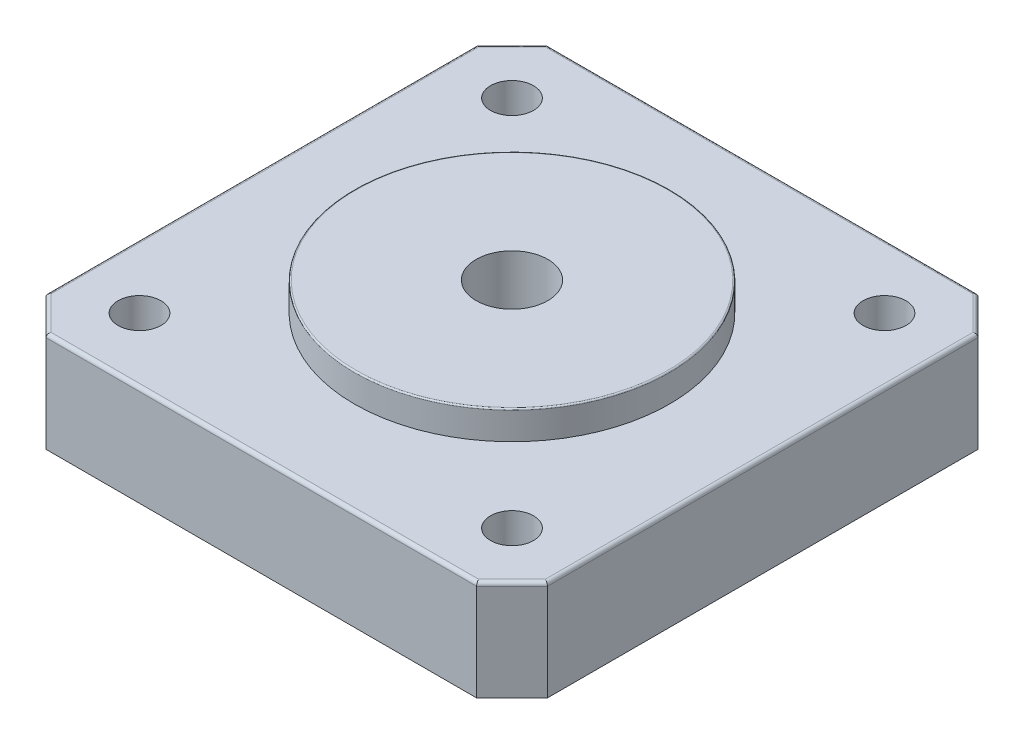
ISO-10303-21;
HEADER;
FILE_DESCRIPTION(('STEP AP214'),'2;1');
FILE_NAME('part.step','',(''),(''),'','','');
FILE_SCHEMA(('AUTOMOTIVE_DESIGN { 1 0 10303 214 1 1 1 1 }'));
ENDSEC;
DATA;
#1=APPLICATION_CONTEXT('core data for automotive mechanical design processes');
#2=APPLICATION_PROTOCOL_DEFINITION('international standard','automotive_design',2000,#1);
#3=PRODUCT_CONTEXT('',#1,'mechanical');
#4=PRODUCT('Part','Part','',(#3));
#5=PRODUCT_RELATED_PRODUCT_CATEGORY('part','',(#4));
#6=PRODUCT_DEFINITION_FORMATION('','',#4);
#7=PRODUCT_DEFINITION_CONTEXT('part definition',#1,'design');
#8=PRODUCT_DEFINITION('design','',#6,#7);
#9=PRODUCT_DEFINITION_SHAPE('','',#8);
#10=(LENGTH_UNIT() NAMED_UNIT(*) SI_UNIT(.MILLI.,.METRE.));
#11=(NAMED_UNIT(*) PLANE_ANGLE_UNIT() SI_UNIT($,.RADIAN.));
#12=(NAMED_UNIT(*) SI_UNIT($,.STERADIAN.) SOLID_ANGLE_UNIT());
#13=UNCERTAINTY_MEASURE_WITH_UNIT(LENGTH_MEASURE(1.E-05),#10,'distance_accuracy_value','');
#14=(GEOMETRIC_REPRESENTATION_CONTEXT(3) GLOBAL_UNCERTAINTY_ASSIGNED_CONTEXT((#13)) GLOBAL_UNIT_ASSIGNED_CONTEXT((#10,
#11,#12)) REPRESENTATION_CONTEXT('',''));
#15=CARTESIAN_POINT('',(0.,0.,0.));
#16=DIRECTION('',(0.,0.,1.));
#17=DIRECTION('',(1.,0.,0.));
#18=AXIS2_PLACEMENT_3D('',#15,#16,#17);
#19=CARTESIAN_POINT('',(0.,7.,0.));
#20=DIRECTION('',(0.,-1.,0.));
#21=DIRECTION('',(0.,0.,-1.));
#22=AXIS2_PLACEMENT_3D('',#19,#20,#21);
#23=PLANE('',#22);
#24=DIRECTION('',(-1.,0.,0.));
#25=VECTOR('',#24,1.);
#26=CARTESIAN_POINT('',(0.,7.,-34.75));
#27=LINE('',#26,#25);
#28=CARTESIAN_POINT('',(32.4233585439879,7.,-34.75));
#29=VERTEX_POINT('',#28);
#30=CARTESIAN_POINT('',(2.5766414560121,7.,-34.75));
#31=VERTEX_POINT('',#30);
#32=EDGE_CURVE('E198',#29,#31,#27,.T.);
#33=ORIENTED_EDGE('',*,*,#32,.T.);
#34=DIRECTION('',(-0.707106781186548,0.,0.707106781186548));
#35=VECTOR('',#34,1.);
#36=CARTESIAN_POINT('',(-16.0866792719939,7.,-16.0866792719939));
#37=LINE('',#36,#35);
#38=CARTESIAN_POINT('',(0.25,7.,-32.4233585439879));
#39=VERTEX_POINT('',#38);
#40=EDGE_CURVE('E200',#31,#39,#37,.T.);
#41=ORIENTED_EDGE('',*,*,#40,.T.);
#42=DIRECTION('',(0.,0.,1.));
#43=VECTOR('',#42,1.);
#44=CARTESIAN_POINT('',(0.250000000000008,7.,0.));
#45=LINE('',#44,#43);
#46=CARTESIAN_POINT('',(0.250000000000007,7.,-2.57664145601209));
#47=VERTEX_POINT('',#46);
#48=EDGE_CURVE('E186',#39,#47,#45,.T.);
#49=ORIENTED_EDGE('',*,*,#48,.T.);
#50=DIRECTION('',(0.707106781186618,0.,0.707106781186477));
#51=VECTOR('',#50,1.);
#52=CARTESIAN_POINT('',(1.41332072800602,7.,-1.41332072800631));
#53=LINE('',#52,#51);
#54=CARTESIAN_POINT('',(2.57664145601238,7.,-0.250000000000184));
#55=VERTEX_POINT('',#54);
#56=EDGE_CURVE('E188',#47,#55,#53,.T.);
#57=ORIENTED_EDGE('',*,*,#56,.T.);
#58=DIRECTION('',(1.,0.,0.));
#59=VECTOR('',#58,1.);
#60=CARTESIAN_POINT('',(0.,7.,-0.250000000000201));
#61=LINE('',#60,#59);
#62=CARTESIAN_POINT('',(32.4233585439879,7.,-0.249999999999987));
#63=VERTEX_POINT('',#62);
#64=EDGE_CURVE('E190',#55,#63,#61,.T.);
#65=ORIENTED_EDGE('',*,*,#64,.T.);
#66=DIRECTION('',(0.707106781186548,0.,-0.707106781186548));
#67=VECTOR('',#66,1.);
#68=CARTESIAN_POINT('',(16.086679271994,7.,16.086679271994));
#69=LINE('',#68,#67);
#70=CARTESIAN_POINT('',(34.75,7.,-2.57664145601208));
#71=VERTEX_POINT('',#70);
#72=EDGE_CURVE('E192',#63,#71,#69,.T.);
#73=ORIENTED_EDGE('',*,*,#72,.T.);
#74=DIRECTION('',(0.,0.,-1.));
#75=VECTOR('',#74,1.);
#76=CARTESIAN_POINT('',(34.75,7.,0.));
#77=LINE('',#76,#75);
#78=CARTESIAN_POINT('',(34.75,7.,-32.4233585439879));
#79=VERTEX_POINT('',#78);
#80=EDGE_CURVE('E194',#71,#79,#77,.T.);
#81=ORIENTED_EDGE('',*,*,#80,.T.);
#82=DIRECTION('',(-0.707106781186547,0.,-0.707106781186548));
#83=VECTOR('',#82,1.);
#84=CARTESIAN_POINT('',(33.586679271994,7.,-33.5866792719939));
#85=LINE('',#84,#83);
#86=EDGE_CURVE('E196',#79,#29,#85,.T.);
#87=ORIENTED_EDGE('',*,*,#86,.T.);
#88=EDGE_LOOP('',(#33,#41,#49,#57,#65,#73,#81,#87));
#89=FACE_BOUND('',#88,.T.);
#90=CARTESIAN_POINT('',(4.50000000000001,7.,-30.5));
#91=DIRECTION('',(0.,1.,0.));
#92=DIRECTION('',(0.,0.,1.));
#93=AXIS2_PLACEMENT_3D('',#90,#91,#92);
#94=CIRCLE('',#93,1.5);
#95=CARTESIAN_POINT('',(4.50000000000001,7.,-29.));
#96=VERTEX_POINT('',#95);
#97=EDGE_CURVE('E263',#96,#96,#94,.T.);
#98=ORIENTED_EDGE('',*,*,#97,.F.);
#99=EDGE_LOOP('',(#98));
#100=FACE_BOUND('',#99,.T.);
#101=CARTESIAN_POINT('',(30.5000000000001,7.,-30.5000000000003));
#102=DIRECTION('',(0.,1.,0.));
#103=DIRECTION('',(0.,0.,1.));
#104=AXIS2_PLACEMENT_3D('',#101,#102,#103);
#105=CIRCLE('',#104,1.5);
#106=CARTESIAN_POINT('',(30.5000000000001,7.,-29.0000000000003));
#107=VERTEX_POINT('',#106);
#108=EDGE_CURVE('E257',#107,#107,#105,.T.);
#109=ORIENTED_EDGE('',*,*,#108,.F.);
#110=EDGE_LOOP('',(#109));
#111=FACE_BOUND('',#110,.T.);
#112=CARTESIAN_POINT('',(30.5000000000003,7.,-4.50000000000026));
#113=DIRECTION('',(0.,1.,0.));
#114=DIRECTION('',(0.,0.,1.));
#115=AXIS2_PLACEMENT_3D('',#112,#113,#114);
#116=CIRCLE('',#115,1.5);
#117=CARTESIAN_POINT('',(30.5000000000003,7.,-3.00000000000026));
#118=VERTEX_POINT('',#117);
#119=EDGE_CURVE('E252',#118,#118,#116,.T.);
#120=ORIENTED_EDGE('',*,*,#119,.F.);
#121=EDGE_LOOP('',(#120));
#122=FACE_BOUND('',#121,.T.);
#123=CARTESIAN_POINT('',(4.50000000000024,7.,-4.50000000000012));
#124=DIRECTION('',(0.,1.,0.));
#125=DIRECTION('',(0.,0.,1.));
#126=AXIS2_PLACEMENT_3D('',#123,#124,#125);
#127=CIRCLE('',#126,1.5);
#128=CARTESIAN_POINT('',(4.50000000000024,7.,-3.00000000000012));
#129=VERTEX_POINT('',#128);
#130=EDGE_CURVE('E243',#129,#129,#127,.T.);
#131=ORIENTED_EDGE('',*,*,#130,.F.);
#132=EDGE_LOOP('',(#131));
#133=FACE_BOUND('',#132,.T.);
#134=CARTESIAN_POINT('',(17.5,7.,-17.5));
#135=DIRECTION('',(0.,-1.,0.));
#136=DIRECTION('',(0.,0.,-1.));
#137=AXIS2_PLACEMENT_3D('',#134,#135,#136);
#138=CIRCLE('',#137,11.);
#139=CARTESIAN_POINT('',(17.5,7.,-28.5));
#140=VERTEX_POINT('',#139);
#141=EDGE_CURVE('E128',#140,#140,#138,.F.);
#142=ORIENTED_EDGE('',*,*,#141,.F.);
#143=EDGE_LOOP('',(#142));
#144=FACE_BOUND('',#143,.T.);
#145=ADVANCED_FACE('F32',(#89,#100,#111,#122,#133,#144),#23,.F.);
#146=CARTESIAN_POINT('',(0.,7.,-2.4730880654188));
#147=DIRECTION('',(1.,0.,0.));
#148=DIRECTION('',(0.,0.,-1.));
#149=AXIS2_PLACEMENT_3D('',#146,#147,#148);
#150=PLANE('',#149);
#151=DIRECTION('',(0.,-1.,0.));
#152=VECTOR('',#151,1.);
#153=CARTESIAN_POINT('',(0.,7.,-2.4730880654188));
#154=LINE('',#153,#152);
#155=CARTESIAN_POINT('',(0.,6.75,-2.4730880654188));
#156=VERTEX_POINT('',#155);
#157=CARTESIAN_POINT('',(0.,0.,-2.4730880654188));
#158=VERTEX_POINT('',#157);
#159=EDGE_CURVE('E120',#156,#158,#154,.T.);
#160=ORIENTED_EDGE('',*,*,#159,.F.);
#161=DIRECTION('',(0.,0.,1.));
#162=VECTOR('',#161,1.);
#163=CARTESIAN_POINT('',(0.,6.75,-2.4730880654188));
#164=LINE('',#163,#162);
#165=CARTESIAN_POINT('',(0.,6.75,-32.5269119345812));
#166=VERTEX_POINT('',#165);
#167=EDGE_CURVE('E11',#156,#166,#164,.F.);
#168=ORIENTED_EDGE('',*,*,#167,.T.);
#169=DIRECTION('',(0.,-1.,0.));
#170=VECTOR('',#169,1.);
#171=CARTESIAN_POINT('',(0.,7.,-32.5269119345812));
#172=LINE('',#171,#170);
#173=CARTESIAN_POINT('',(0.,0.,-32.5269119345812));
#174=VERTEX_POINT('',#173);
#175=EDGE_CURVE('E142',#166,#174,#172,.T.);
#176=ORIENTED_EDGE('',*,*,#175,.T.);
#177=DIRECTION('',(0.,0.,1.));
#178=VECTOR('',#177,1.);
#179=CARTESIAN_POINT('',(0.,0.,-2.4730880654188));
#180=LINE('',#179,#178);
#181=EDGE_CURVE('E135',#174,#158,#180,.T.);
#182=ORIENTED_EDGE('',*,*,#181,.T.);
#183=EDGE_LOOP('',(#160,#168,#176,#182));
#184=FACE_BOUND('',#183,.T.);
#185=ADVANCED_FACE('F140',(#184),#150,.F.);
#186=CARTESIAN_POINT('',(2.47308806541912,7.,-1.8457620525144E-13));
#187=DIRECTION('',(0.707106781186477,0.,-0.707106781186618));
#188=DIRECTION('',(-0.707106781186618,0.,-0.707106781186477));
#189=AXIS2_PLACEMENT_3D('',#186,#187,#188);
#190=PLANE('',#189);
#191=DIRECTION('',(0.,-1.,0.));
#192=VECTOR('',#191,1.);
#193=CARTESIAN_POINT('',(2.47308806541912,7.,-1.8457620525144E-13));
#194=LINE('',#193,#192);
#195=CARTESIAN_POINT('',(2.47308806541912,6.75,-1.8457620525144E-13));
#196=VERTEX_POINT('',#195);
#197=CARTESIAN_POINT('',(2.47308806541912,0.,-1.8457620525144E-13));
#198=VERTEX_POINT('',#197);
#199=EDGE_CURVE('E129',#196,#198,#194,.T.);
#200=ORIENTED_EDGE('',*,*,#199,.F.);
#201=DIRECTION('',(0.707106781186618,0.,0.707106781186477));
#202=VECTOR('',#201,1.);
#203=CARTESIAN_POINT('',(2.47308806541912,6.75,-1.8457620525144E-13));
#204=LINE('',#203,#202);
#205=EDGE_CURVE('E41',#196,#156,#204,.F.);
#206=ORIENTED_EDGE('',*,*,#205,.T.);
#207=ORIENTED_EDGE('',*,*,#159,.T.);
#208=DIRECTION('',(0.707106781186618,0.,0.707106781186477));
#209=VECTOR('',#208,1.);
#210=CARTESIAN_POINT('',(2.47308806541912,0.,-1.8457620525144E-13));
#211=LINE('',#210,#209);
#212=EDGE_CURVE('E123',#158,#198,#211,.T.);
#213=ORIENTED_EDGE('',*,*,#212,.T.);
#214=EDGE_LOOP('',(#200,#206,#207,#213));
#215=FACE_BOUND('',#214,.T.);
#216=ADVANCED_FACE('F122',(#215),#190,.F.);
#217=CARTESIAN_POINT('',(2.47308806541912,7.,-1.8457620525144E-13));
#218=DIRECTION('',(0.,0.,-1.));
#219=DIRECTION('',(-1.,0.,0.));
#220=AXIS2_PLACEMENT_3D('',#217,#218,#219);
#221=PLANE('',#220);
#222=DIRECTION('',(0.,-1.,0.));
#223=VECTOR('',#222,1.);
#224=CARTESIAN_POINT('',(32.5269119345812,7.,0.));
#225=LINE('',#224,#223);
#226=CARTESIAN_POINT('',(32.5269119345812,6.75,0.));
#227=VERTEX_POINT('',#226);
#228=CARTESIAN_POINT('',(32.5269119345812,0.,0.));
#229=VERTEX_POINT('',#228);
#230=EDGE_CURVE('E175',#227,#229,#225,.T.);
#231=ORIENTED_EDGE('',*,*,#230,.F.);
#232=DIRECTION('',(1.,0.,0.));
#233=VECTOR('',#232,1.);
#234=CARTESIAN_POINT('',(2.47308806541912,6.75,-1.8457620525144E-13));
#235=LINE('',#234,#233);
#236=EDGE_CURVE('E56',#227,#196,#235,.F.);
#237=ORIENTED_EDGE('',*,*,#236,.T.);
#238=ORIENTED_EDGE('',*,*,#199,.T.);
#239=DIRECTION('',(1.,0.,0.));
#240=VECTOR('',#239,1.);
#241=CARTESIAN_POINT('',(2.47308806541912,0.,-1.8457620525144E-13));
#242=LINE('',#241,#240);
#243=EDGE_CURVE('E138',#198,#229,#242,.T.);
#244=ORIENTED_EDGE('',*,*,#243,.T.);
#245=EDGE_LOOP('',(#231,#237,#238,#244));
#246=FACE_BOUND('',#245,.T.);
#247=ADVANCED_FACE('F340',(#246),#221,.F.);
#248=CARTESIAN_POINT('',(35.,7.,-2.47308806541881));
#249=DIRECTION('',(-0.707106781186547,0.,-0.707106781186547));
#250=DIRECTION('',(-0.707106781186548,0.,0.707106781186548));
#251=AXIS2_PLACEMENT_3D('',#248,#249,#250);
#252=PLANE('',#251);
#253=DIRECTION('',(0.,-1.,0.));
#254=VECTOR('',#253,1.);
#255=CARTESIAN_POINT('',(35.,7.,-2.47308806541881));
#256=LINE('',#255,#254);
#257=CARTESIAN_POINT('',(35.,6.75,-2.47308806541881));
#258=VERTEX_POINT('',#257);
#259=CARTESIAN_POINT('',(35.,0.,-2.47308806541881));
#260=VERTEX_POINT('',#259);
#261=EDGE_CURVE('E173',#258,#260,#256,.T.);
#262=ORIENTED_EDGE('',*,*,#261,.F.);
#263=DIRECTION('',(0.707106781186548,0.,-0.707106781186548));
#264=VECTOR('',#263,1.);
#265=CARTESIAN_POINT('',(35.,6.75,-2.47308806541881));
#266=LINE('',#265,#264);
#267=EDGE_CURVE('E212',#258,#227,#266,.F.);
#268=ORIENTED_EDGE('',*,*,#267,.T.);
#269=ORIENTED_EDGE('',*,*,#230,.T.);
#270=DIRECTION('',(0.707106781186548,0.,-0.707106781186548));
#271=VECTOR('',#270,1.);
#272=CARTESIAN_POINT('',(35.,0.,-2.47308806541881));
#273=LINE('',#272,#271);
#274=EDGE_CURVE('E152',#229,#260,#273,.T.);
#275=ORIENTED_EDGE('',*,*,#274,.T.);
#276=EDGE_LOOP('',(#262,#268,#269,#275));
#277=FACE_BOUND('',#276,.T.);
#278=ADVANCED_FACE('F336',(#277),#252,.F.);
#279=CARTESIAN_POINT('',(35.,7.,-2.47308806541881));
#280=DIRECTION('',(-1.,0.,0.));
#281=DIRECTION('',(0.,0.,1.));
#282=AXIS2_PLACEMENT_3D('',#279,#280,#281);
#283=PLANE('',#282);
#284=DIRECTION('',(0.,-1.,0.));
#285=VECTOR('',#284,1.);
#286=CARTESIAN_POINT('',(35.,7.,-32.5269119345812));
#287=LINE('',#286,#285);
#288=CARTESIAN_POINT('',(35.,6.75,-32.5269119345812));
#289=VERTEX_POINT('',#288);
#290=CARTESIAN_POINT('',(35.,0.,-32.5269119345812));
#291=VERTEX_POINT('',#290);
#292=EDGE_CURVE('E171',#289,#291,#287,.T.);
#293=ORIENTED_EDGE('',*,*,#292,.F.);
#294=DIRECTION('',(0.,0.,-1.));
#295=VECTOR('',#294,1.);
#296=CARTESIAN_POINT('',(35.,6.75,-2.47308806541881));
#297=LINE('',#296,#295);
#298=EDGE_CURVE('E210',#289,#258,#297,.F.);
#299=ORIENTED_EDGE('',*,*,#298,.T.);
#300=ORIENTED_EDGE('',*,*,#261,.T.);
#301=DIRECTION('',(0.,0.,-1.));
#302=VECTOR('',#301,1.);
#303=CARTESIAN_POINT('',(35.,0.,-2.47308806541881));
#304=LINE('',#303,#302);
#305=EDGE_CURVE('E155',#260,#291,#304,.T.);
#306=ORIENTED_EDGE('',*,*,#305,.T.);
#307=EDGE_LOOP('',(#293,#299,#300,#306));
#308=FACE_BOUND('',#307,.T.);
#309=ADVANCED_FACE('F332',(#308),#283,.F.);
#310=CARTESIAN_POINT('',(32.5269119345812,7.,-35.));
#311=DIRECTION('',(-0.707106781186548,0.,0.707106781186547));
#312=DIRECTION('',(0.707106781186547,0.,0.707106781186548));
#313=AXIS2_PLACEMENT_3D('',#310,#311,#312);
#314=PLANE('',#313);
#315=DIRECTION('',(0.,-1.,0.));
#316=VECTOR('',#315,1.);
#317=CARTESIAN_POINT('',(32.5269119345812,7.,-35.));
#318=LINE('',#317,#316);
#319=CARTESIAN_POINT('',(32.5269119345812,6.75,-35.));
#320=VERTEX_POINT('',#319);
#321=CARTESIAN_POINT('',(32.5269119345812,0.,-35.));
#322=VERTEX_POINT('',#321);
#323=EDGE_CURVE('E169',#320,#322,#318,.T.);
#324=ORIENTED_EDGE('',*,*,#323,.F.);
#325=DIRECTION('',(-0.707106781186547,0.,-0.707106781186548));
#326=VECTOR('',#325,1.);
#327=CARTESIAN_POINT('',(32.5269119345812,6.75,-35.));
#328=LINE('',#327,#326);
#329=EDGE_CURVE('E208',#320,#289,#328,.F.);
#330=ORIENTED_EDGE('',*,*,#329,.T.);
#331=ORIENTED_EDGE('',*,*,#292,.T.);
#332=DIRECTION('',(-0.707106781186547,0.,-0.707106781186548));
#333=VECTOR('',#332,1.);
#334=CARTESIAN_POINT('',(32.5269119345812,0.,-35.));
#335=LINE('',#334,#333);
#336=EDGE_CURVE('E158',#291,#322,#335,.T.);
#337=ORIENTED_EDGE('',*,*,#336,.T.);
#338=EDGE_LOOP('',(#324,#330,#331,#337));
#339=FACE_BOUND('',#338,.T.);
#340=ADVANCED_FACE('F328',(#339),#314,.F.);
#341=CARTESIAN_POINT('',(2.47308806541883,7.,-35.));
#342=DIRECTION('',(0.,0.,1.));
#343=DIRECTION('',(1.,0.,0.));
#344=AXIS2_PLACEMENT_3D('',#341,#342,#343);
#345=PLANE('',#344);
#346=DIRECTION('',(0.,-1.,0.));
#347=VECTOR('',#346,1.);
#348=CARTESIAN_POINT('',(2.47308806541883,7.,-35.));
#349=LINE('',#348,#347);
#350=CARTESIAN_POINT('',(2.47308806541883,6.75,-35.));
#351=VERTEX_POINT('',#350);
#352=CARTESIAN_POINT('',(2.47308806541883,0.,-35.));
#353=VERTEX_POINT('',#352);
#354=EDGE_CURVE('E167',#351,#353,#349,.T.);
#355=ORIENTED_EDGE('',*,*,#354,.F.);
#356=DIRECTION('',(-1.,0.,0.));
#357=VECTOR('',#356,1.);
#358=CARTESIAN_POINT('',(2.47308806541883,6.75,-35.));
#359=LINE('',#358,#357);
#360=EDGE_CURVE('E206',#351,#320,#359,.F.);
#361=ORIENTED_EDGE('',*,*,#360,.T.);
#362=ORIENTED_EDGE('',*,*,#323,.T.);
#363=DIRECTION('',(-1.,0.,0.));
#364=VECTOR('',#363,1.);
#365=CARTESIAN_POINT('',(2.47308806541883,0.,-35.));
#366=LINE('',#365,#364);
#367=EDGE_CURVE('E161',#322,#353,#366,.T.);
#368=ORIENTED_EDGE('',*,*,#367,.T.);
#369=EDGE_LOOP('',(#355,#361,#362,#368));
#370=FACE_BOUND('',#369,.T.);
#371=ADVANCED_FACE('F324',(#370),#345,.F.);
#372=CARTESIAN_POINT('',(0.,7.,-32.5269119345812));
#373=DIRECTION('',(0.707106781186547,0.,0.707106781186547));
#374=DIRECTION('',(0.707106781186548,0.,-0.707106781186548));
#375=AXIS2_PLACEMENT_3D('',#372,#373,#374);
#376=PLANE('',#375);
#377=ORIENTED_EDGE('',*,*,#175,.F.);
#378=DIRECTION('',(-0.707106781186548,0.,0.707106781186548));
#379=VECTOR('',#378,1.);
#380=CARTESIAN_POINT('',(0.,6.75,-32.5269119345812));
#381=LINE('',#380,#379);
#382=EDGE_CURVE('E203',#166,#351,#381,.F.);
#383=ORIENTED_EDGE('',*,*,#382,.T.);
#384=ORIENTED_EDGE('',*,*,#354,.T.);
#385=DIRECTION('',(-0.707106781186548,0.,0.707106781186548));
#386=VECTOR('',#385,1.);
#387=CARTESIAN_POINT('',(0.,0.,-32.5269119345812));
#388=LINE('',#387,#386);
#389=EDGE_CURVE('E164',#353,#174,#388,.T.);
#390=ORIENTED_EDGE('',*,*,#389,.T.);
#391=EDGE_LOOP('',(#377,#383,#384,#390));
#392=FACE_BOUND('',#391,.T.);
#393=ADVANCED_FACE('F320',(#392),#376,.F.);
#394=CARTESIAN_POINT('',(0.,0.,0.));
#395=DIRECTION('',(0.,-1.,0.));
#396=DIRECTION('',(0.,0.,-1.));
#397=AXIS2_PLACEMENT_3D('',#394,#395,#396);
#398=PLANE('',#397);
#399=CARTESIAN_POINT('',(4.50000000000024,0.,-4.50000000000012));
#400=DIRECTION('',(0.,1.,0.));
#401=DIRECTION('',(0.,0.,1.));
#402=AXIS2_PLACEMENT_3D('',#399,#400,#401);
#403=CIRCLE('',#402,1.5);
#404=CARTESIAN_POINT('',(4.50000000000024,0.,-3.00000000000012));
#405=VERTEX_POINT('',#404);
#406=EDGE_CURVE('E248',#405,#405,#403,.T.);
#407=ORIENTED_EDGE('',*,*,#406,.T.);
#408=EDGE_LOOP('',(#407));
#409=FACE_BOUND('',#408,.T.);
#410=CARTESIAN_POINT('',(30.5000000000003,0.,-4.50000000000026));
#411=DIRECTION('',(0.,1.,0.));
#412=DIRECTION('',(0.,0.,1.));
#413=AXIS2_PLACEMENT_3D('',#410,#411,#412);
#414=CIRCLE('',#413,1.5);
#415=CARTESIAN_POINT('',(30.5000000000003,0.,-3.00000000000026));
#416=VERTEX_POINT('',#415);
#417=EDGE_CURVE('E254',#416,#416,#414,.T.);
#418=ORIENTED_EDGE('',*,*,#417,.T.);
#419=EDGE_LOOP('',(#418));
#420=FACE_BOUND('',#419,.T.);
#421=CARTESIAN_POINT('',(30.5000000000001,0.,-30.5000000000003));
#422=DIRECTION('',(0.,1.,0.));
#423=DIRECTION('',(0.,0.,1.));
#424=AXIS2_PLACEMENT_3D('',#421,#422,#423);
#425=CIRCLE('',#424,1.5);
#426=CARTESIAN_POINT('',(30.5000000000001,0.,-29.0000000000003));
#427=VERTEX_POINT('',#426);
#428=EDGE_CURVE('E260',#427,#427,#425,.T.);
#429=ORIENTED_EDGE('',*,*,#428,.T.);
#430=EDGE_LOOP('',(#429));
#431=FACE_BOUND('',#430,.T.);
#432=CARTESIAN_POINT('',(4.50000000000001,0.,-30.5));
#433=DIRECTION('',(0.,1.,0.));
#434=DIRECTION('',(0.,0.,1.));
#435=AXIS2_PLACEMENT_3D('',#432,#433,#434);
#436=CIRCLE('',#435,1.5);
#437=CARTESIAN_POINT('',(4.50000000000001,0.,-29.));
#438=VERTEX_POINT('',#437);
#439=EDGE_CURVE('E147',#438,#438,#436,.T.);
#440=ORIENTED_EDGE('',*,*,#439,.T.);
#441=EDGE_LOOP('',(#440));
#442=FACE_BOUND('',#441,.T.);
#443=CARTESIAN_POINT('',(17.5,0.,-17.5));
#444=DIRECTION('',(0.,1.,0.));
#445=DIRECTION('',(0.,0.,1.));
#446=AXIS2_PLACEMENT_3D('',#443,#444,#445);
#447=CIRCLE('',#446,2.5);
#448=CARTESIAN_POINT('',(17.5,0.,-15.));
#449=VERTEX_POINT('',#448);
#450=EDGE_CURVE('E144',#449,#449,#447,.T.);
#451=ORIENTED_EDGE('',*,*,#450,.T.);
#452=EDGE_LOOP('',(#451));
#453=FACE_BOUND('',#452,.T.);
#454=ORIENTED_EDGE('',*,*,#181,.F.);
#455=ORIENTED_EDGE('',*,*,#389,.F.);
#456=ORIENTED_EDGE('',*,*,#367,.F.);
#457=ORIENTED_EDGE('',*,*,#336,.F.);
#458=ORIENTED_EDGE('',*,*,#305,.F.);
#459=ORIENTED_EDGE('',*,*,#274,.F.);
#460=ORIENTED_EDGE('',*,*,#243,.F.);
#461=ORIENTED_EDGE('',*,*,#212,.F.);
#462=EDGE_LOOP('',(#454,#455,#456,#457,#458,#459,#460,#461));
#463=FACE_BOUND('',#462,.T.);
#464=ADVANCED_FACE('F133',(#409,#420,#431,#442,#453,#463),#398,.T.);
#465=CARTESIAN_POINT('',(17.5,0.,-17.5));
#466=DIRECTION('',(0.,1.,0.));
#467=DIRECTION('',(0.,0.,1.));
#468=AXIS2_PLACEMENT_3D('',#465,#466,#467);
#469=CYLINDRICAL_SURFACE('',#468,2.5);
#470=ORIENTED_EDGE('',*,*,#450,.F.);
#471=EDGE_LOOP('',(#470));
#472=FACE_BOUND('',#471,.T.);
#473=CARTESIAN_POINT('',(17.5,9.,-17.5));
#474=DIRECTION('',(0.,1.,0.));
#475=DIRECTION('',(0.,0.,1.));
#476=AXIS2_PLACEMENT_3D('',#473,#474,#475);
#477=CIRCLE('',#476,2.5);
#478=CARTESIAN_POINT('',(17.5,9.,-15.));
#479=VERTEX_POINT('',#478);
#480=EDGE_CURVE('E237',#479,#479,#477,.T.);
#481=ORIENTED_EDGE('',*,*,#480,.T.);
#482=EDGE_LOOP('',(#481));
#483=FACE_BOUND('',#482,.T.);
#484=ADVANCED_FACE('F313',(#472,#483),#469,.F.);
#485=CARTESIAN_POINT('',(4.50000000000001,0.,-30.5));
#486=DIRECTION('',(0.,1.,0.));
#487=DIRECTION('',(0.,0.,1.));
#488=AXIS2_PLACEMENT_3D('',#485,#486,#487);
#489=CYLINDRICAL_SURFACE('',#488,1.5);
#490=ORIENTED_EDGE('',*,*,#439,.F.);
#491=EDGE_LOOP('',(#490));
#492=FACE_BOUND('',#491,.T.);
#493=ORIENTED_EDGE('',*,*,#97,.T.);
#494=EDGE_LOOP('',(#493));
#495=FACE_BOUND('',#494,.T.);
#496=ADVANCED_FACE('F270',(#492,#495),#489,.F.);
#497=CARTESIAN_POINT('',(30.5000000000001,0.,-30.5000000000003));
#498=DIRECTION('',(0.,1.,0.));
#499=DIRECTION('',(0.,0.,1.));
#500=AXIS2_PLACEMENT_3D('',#497,#498,#499);
#501=CYLINDRICAL_SURFACE('',#500,1.5);
#502=ORIENTED_EDGE('',*,*,#428,.F.);
#503=EDGE_LOOP('',(#502));
#504=FACE_BOUND('',#503,.T.);
#505=ORIENTED_EDGE('',*,*,#108,.T.);
#506=EDGE_LOOP('',(#505));
#507=FACE_BOUND('',#506,.T.);
#508=ADVANCED_FACE('F306',(#504,#507),#501,.F.);
#509=CARTESIAN_POINT('',(30.5000000000003,0.,-4.50000000000026));
#510=DIRECTION('',(0.,1.,0.));
#511=DIRECTION('',(0.,0.,1.));
#512=AXIS2_PLACEMENT_3D('',#509,#510,#511);
#513=CYLINDRICAL_SURFACE('',#512,1.5);
#514=ORIENTED_EDGE('',*,*,#417,.F.);
#515=EDGE_LOOP('',(#514));
#516=FACE_BOUND('',#515,.T.);
#517=ORIENTED_EDGE('',*,*,#119,.T.);
#518=EDGE_LOOP('',(#517));
#519=FACE_BOUND('',#518,.T.);
#520=ADVANCED_FACE('F302',(#516,#519),#513,.F.);
#521=CARTESIAN_POINT('',(4.50000000000024,0.,-4.50000000000012));
#522=DIRECTION('',(0.,1.,0.));
#523=DIRECTION('',(0.,0.,1.));
#524=AXIS2_PLACEMENT_3D('',#521,#522,#523);
#525=CYLINDRICAL_SURFACE('',#524,1.5);
#526=ORIENTED_EDGE('',*,*,#406,.F.);
#527=EDGE_LOOP('',(#526));
#528=FACE_BOUND('',#527,.T.);
#529=ORIENTED_EDGE('',*,*,#130,.T.);
#530=EDGE_LOOP('',(#529));
#531=FACE_BOUND('',#530,.T.);
#532=ADVANCED_FACE('F296',(#528,#531),#525,.F.);
#533=CARTESIAN_POINT('',(17.5,9.,-17.5));
#534=DIRECTION('',(0.,1.,0.));
#535=DIRECTION('',(0.,0.,1.));
#536=AXIS2_PLACEMENT_3D('',#533,#534,#535);
#537=PLANE('',#536);
#538=CARTESIAN_POINT('',(17.5,9.,-17.5));
#539=DIRECTION('',(0.,1.,0.));
#540=DIRECTION('',(0.,0.,1.));
#541=AXIS2_PLACEMENT_3D('',#538,#539,#540);
#542=CIRCLE('',#541,10.9);
#543=CARTESIAN_POINT('',(17.5,9.,-6.59999999999999));
#544=VERTEX_POINT('',#543);
#545=EDGE_CURVE('E180',#544,#544,#542,.T.);
#546=ORIENTED_EDGE('',*,*,#545,.T.);
#547=EDGE_LOOP('',(#546));
#548=FACE_BOUND('',#547,.T.);
#549=ORIENTED_EDGE('',*,*,#480,.F.);
#550=EDGE_LOOP('',(#549));
#551=FACE_BOUND('',#550,.T.);
#552=ADVANCED_FACE('F287',(#548,#551),#537,.T.);
#553=CARTESIAN_POINT('',(17.5,9.,-17.5));
#554=DIRECTION('',(0.,-1.,0.));
#555=DIRECTION('',(0.,0.,-1.));
#556=AXIS2_PLACEMENT_3D('',#553,#554,#555);
#557=CYLINDRICAL_SURFACE('',#556,11.);
#558=CARTESIAN_POINT('',(17.5,8.9,-17.5));
#559=DIRECTION('',(0.,1.,0.));
#560=DIRECTION('',(0.,0.,1.));
#561=AXIS2_PLACEMENT_3D('',#558,#559,#560);
#562=CIRCLE('',#561,11.);
#563=CARTESIAN_POINT('',(17.5,8.9,-6.5));
#564=VERTEX_POINT('',#563);
#565=EDGE_CURVE('E183',#564,#564,#562,.F.);
#566=ORIENTED_EDGE('',*,*,#565,.T.);
#567=EDGE_LOOP('',(#566));
#568=FACE_BOUND('',#567,.T.);
#569=ORIENTED_EDGE('',*,*,#141,.T.);
#570=EDGE_LOOP('',(#569));
#571=FACE_BOUND('',#570,.T.);
#572=ADVANCED_FACE('F284',(#568,#571),#557,.T.);
#573=CARTESIAN_POINT('',(17.5,8.9,-17.5));
#574=DIRECTION('',(0.,1.,0.));
#575=DIRECTION('',(0.,0.,1.));
#576=AXIS2_PLACEMENT_3D('',#573,#574,#575);
#577=TOROIDAL_SURFACE('',#576,10.9,0.1);
#578=ORIENTED_EDGE('',*,*,#565,.F.);
#579=EDGE_LOOP('',(#578));
#580=FACE_BOUND('',#579,.T.);
#581=ORIENTED_EDGE('',*,*,#545,.F.);
#582=EDGE_LOOP('',(#581));
#583=FACE_BOUND('',#582,.T.);
#584=ADVANCED_FACE('F286',(#580,#583),#577,.T.);
#585=CARTESIAN_POINT('',(16.086679271994,6.75,16.086679271994));
#586=DIRECTION('',(0.707106781186548,0.,-0.707106781186548));
#587=DIRECTION('',(-0.707106781186548,0.,-0.707106781186548));
#588=AXIS2_PLACEMENT_3D('',#585,#586,#587);
#589=CYLINDRICAL_SURFACE('',#588,0.25);
#590=CARTESIAN_POINT('',(32.423358543988,6.75,-0.249999999999988));
#591=DIRECTION('',(0.923879532511288,0.,-0.382683432365087));
#592=DIRECTION('',(0.382683432365087,0.,0.923879532511288));
#593=AXIS2_PLACEMENT_3D('',#590,#591,#592);
#594=ELLIPSE('',#593,0.270598050073099,0.25);
#595=EDGE_CURVE('E231',#227,#63,#594,.F.);
#596=ORIENTED_EDGE('',*,*,#595,.F.);
#597=ORIENTED_EDGE('',*,*,#267,.F.);
#598=CARTESIAN_POINT('',(34.75,6.75,-2.57664145601208));
#599=DIRECTION('',(0.38268343236509,0.,-0.923879532511287));
#600=DIRECTION('',(0.923879532511287,0.,0.382683432365089));
#601=AXIS2_PLACEMENT_3D('',#598,#599,#600);
#602=ELLIPSE('',#601,0.270598050073099,0.25);
#603=EDGE_CURVE('E36',#71,#258,#602,.T.);
#604=ORIENTED_EDGE('',*,*,#603,.F.);
#605=ORIENTED_EDGE('',*,*,#72,.F.);
#606=EDGE_LOOP('',(#596,#597,#604,#605));
#607=FACE_BOUND('',#606,.T.);
#608=ADVANCED_FACE('F34',(#607),#589,.T.);
#609=CARTESIAN_POINT('',(34.75,6.75,0.));
#610=DIRECTION('',(0.,0.,-1.));
#611=DIRECTION('',(-1.,0.,0.));
#612=AXIS2_PLACEMENT_3D('',#609,#610,#611);
#613=CYLINDRICAL_SURFACE('',#612,0.25);
#614=ORIENTED_EDGE('',*,*,#603,.T.);
#615=ORIENTED_EDGE('',*,*,#298,.F.);
#616=CARTESIAN_POINT('',(34.75,6.75,-32.4233585439879));
#617=DIRECTION('',(-0.382683432365089,0.,-0.923879532511287));
#618=DIRECTION('',(0.923879532511287,0.,-0.382683432365089));
#619=AXIS2_PLACEMENT_3D('',#616,#617,#618);
#620=ELLIPSE('',#619,0.270598050073098,0.25);
#621=EDGE_CURVE('E229',#79,#289,#620,.T.);
#622=ORIENTED_EDGE('',*,*,#621,.F.);
#623=ORIENTED_EDGE('',*,*,#80,.F.);
#624=EDGE_LOOP('',(#614,#615,#622,#623));
#625=FACE_BOUND('',#624,.T.);
#626=ADVANCED_FACE('F370',(#625),#613,.T.);
#627=CARTESIAN_POINT('',(0.,6.75,-0.250000000000201));
#628=DIRECTION('',(1.,0.,0.));
#629=DIRECTION('',(0.,0.,-1.));
#630=AXIS2_PLACEMENT_3D('',#627,#628,#629);
#631=CYLINDRICAL_SURFACE('',#630,0.25);
#632=ORIENTED_EDGE('',*,*,#595,.T.);
#633=ORIENTED_EDGE('',*,*,#64,.F.);
#634=CARTESIAN_POINT('',(2.57664145601238,6.75,-0.250000000000184));
#635=DIRECTION('',(0.923879532511305,0.,0.382683432365047));
#636=DIRECTION('',(-0.382683432365047,0.,0.923879532511305));
#637=AXIS2_PLACEMENT_3D('',#634,#635,#636);
#638=ELLIPSE('',#637,0.270598050073093,0.25);
#639=EDGE_CURVE('E226',#196,#55,#638,.F.);
#640=ORIENTED_EDGE('',*,*,#639,.F.);
#641=ORIENTED_EDGE('',*,*,#236,.F.);
#642=EDGE_LOOP('',(#632,#633,#640,#641));
#643=FACE_BOUND('',#642,.T.);
#644=ADVANCED_FACE('F367',(#643),#631,.T.);
#645=CARTESIAN_POINT('',(33.586679271994,6.75,-33.5866792719939));
#646=DIRECTION('',(-0.707106781186547,0.,-0.707106781186548));
#647=DIRECTION('',(-0.707106781186548,0.,0.707106781186547));
#648=AXIS2_PLACEMENT_3D('',#645,#646,#647);
#649=CYLINDRICAL_SURFACE('',#648,0.25);
#650=ORIENTED_EDGE('',*,*,#621,.T.);
#651=ORIENTED_EDGE('',*,*,#329,.F.);
#652=CARTESIAN_POINT('',(32.4233585439879,6.75,-34.75));
#653=DIRECTION('',(-0.923879532511287,0.,-0.38268343236509));
#654=DIRECTION('',(0.38268343236509,0.,-0.923879532511287));
#655=AXIS2_PLACEMENT_3D('',#652,#653,#654);
#656=ELLIPSE('',#655,0.270598050073099,0.25);
#657=EDGE_CURVE('E223',#29,#320,#656,.T.);
#658=ORIENTED_EDGE('',*,*,#657,.F.);
#659=ORIENTED_EDGE('',*,*,#86,.F.);
#660=EDGE_LOOP('',(#650,#651,#658,#659));
#661=FACE_BOUND('',#660,.T.);
#662=ADVANCED_FACE('F363',(#661),#649,.T.);
#663=CARTESIAN_POINT('',(1.41332072800602,6.75,-1.41332072800631));
#664=DIRECTION('',(0.707106781186618,0.,0.707106781186477));
#665=DIRECTION('',(0.707106781186477,0.,-0.707106781186618));
#666=AXIS2_PLACEMENT_3D('',#663,#664,#665);
#667=CYLINDRICAL_SURFACE('',#666,0.25);
#668=ORIENTED_EDGE('',*,*,#639,.T.);
#669=ORIENTED_EDGE('',*,*,#56,.F.);
#670=CARTESIAN_POINT('',(0.250000000000007,6.75,-2.57664145601209));
#671=DIRECTION('',(0.382683432365136,0.,0.923879532511268));
#672=DIRECTION('',(-0.923879532511268,0.,0.382683432365136));
#673=AXIS2_PLACEMENT_3D('',#670,#671,#672);
#674=ELLIPSE('',#673,0.270598050073104,0.25);
#675=EDGE_CURVE('E220',#156,#47,#674,.F.);
#676=ORIENTED_EDGE('',*,*,#675,.F.);
#677=ORIENTED_EDGE('',*,*,#205,.F.);
#678=EDGE_LOOP('',(#668,#669,#676,#677));
#679=FACE_BOUND('',#678,.T.);
#680=ADVANCED_FACE('F359',(#679),#667,.T.);
#681=CARTESIAN_POINT('',(0.,6.75,-34.75));
#682=DIRECTION('',(-1.,0.,0.));
#683=DIRECTION('',(0.,0.,1.));
#684=AXIS2_PLACEMENT_3D('',#681,#682,#683);
#685=CYLINDRICAL_SURFACE('',#684,0.25);
#686=ORIENTED_EDGE('',*,*,#657,.T.);
#687=ORIENTED_EDGE('',*,*,#360,.F.);
#688=CARTESIAN_POINT('',(2.57664145601211,6.75,-34.75));
#689=DIRECTION('',(-0.923879532511287,0.,0.38268343236509));
#690=DIRECTION('',(-0.38268343236509,0.,-0.923879532511287));
#691=AXIS2_PLACEMENT_3D('',#688,#689,#690);
#692=ELLIPSE('',#691,0.270598050073099,0.25);
#693=EDGE_CURVE('E218',#31,#351,#692,.T.);
#694=ORIENTED_EDGE('',*,*,#693,.F.);
#695=ORIENTED_EDGE('',*,*,#32,.F.);
#696=EDGE_LOOP('',(#686,#687,#694,#695));
#697=FACE_BOUND('',#696,.T.);
#698=ADVANCED_FACE('F355',(#697),#685,.T.);
#699=CARTESIAN_POINT('',(0.250000000000008,6.75,0.));
#700=DIRECTION('',(0.,0.,1.));
#701=DIRECTION('',(1.,0.,0.));
#702=AXIS2_PLACEMENT_3D('',#699,#700,#701);
#703=CYLINDRICAL_SURFACE('',#702,0.25);
#704=ORIENTED_EDGE('',*,*,#675,.T.);
#705=ORIENTED_EDGE('',*,*,#48,.F.);
#706=CARTESIAN_POINT('',(0.250000000000002,6.75,-32.4233585439879));
#707=DIRECTION('',(-0.38268343236509,0.,0.923879532511287));
#708=DIRECTION('',(0.923879532511287,0.,0.38268343236509));
#709=AXIS2_PLACEMENT_3D('',#706,#707,#708);
#710=ELLIPSE('',#709,0.270598050073099,0.25);
#711=EDGE_CURVE('E216',#166,#39,#710,.F.);
#712=ORIENTED_EDGE('',*,*,#711,.F.);
#713=ORIENTED_EDGE('',*,*,#167,.F.);
#714=EDGE_LOOP('',(#704,#705,#712,#713));
#715=FACE_BOUND('',#714,.T.);
#716=ADVANCED_FACE('F351',(#715),#703,.T.);
#717=CARTESIAN_POINT('',(-16.0866792719939,6.75,-16.0866792719939));
#718=DIRECTION('',(-0.707106781186548,0.,0.707106781186548));
#719=DIRECTION('',(0.707106781186548,0.,0.707106781186548));
#720=AXIS2_PLACEMENT_3D('',#717,#718,#719);
#721=CYLINDRICAL_SURFACE('',#720,0.25);
#722=ORIENTED_EDGE('',*,*,#693,.T.);
#723=ORIENTED_EDGE('',*,*,#382,.F.);
#724=ORIENTED_EDGE('',*,*,#711,.T.);
#725=ORIENTED_EDGE('',*,*,#40,.F.);
#726=EDGE_LOOP('',(#722,#723,#724,#725));
#727=FACE_BOUND('',#726,.T.);
#728=ADVANCED_FACE('F348',(#727),#721,.T.);
#729=CLOSED_SHELL('',(#145,#185,#216,#247,#278,#309,#340,#371,#393,#464,#484,#496,#508,#520,
#532,#552,#572,#584,#608,#626,#644,#662,#680,#698,#716,#728));
#730=MANIFOLD_SOLID_BREP('B2',#729);
#731=ADVANCED_BREP_SHAPE_REPRESENTATION('',(#18,#730),#14);
#732=SHAPE_DEFINITION_REPRESENTATION(#9,#731);
ENDSEC;
END-ISO-10303-21;
